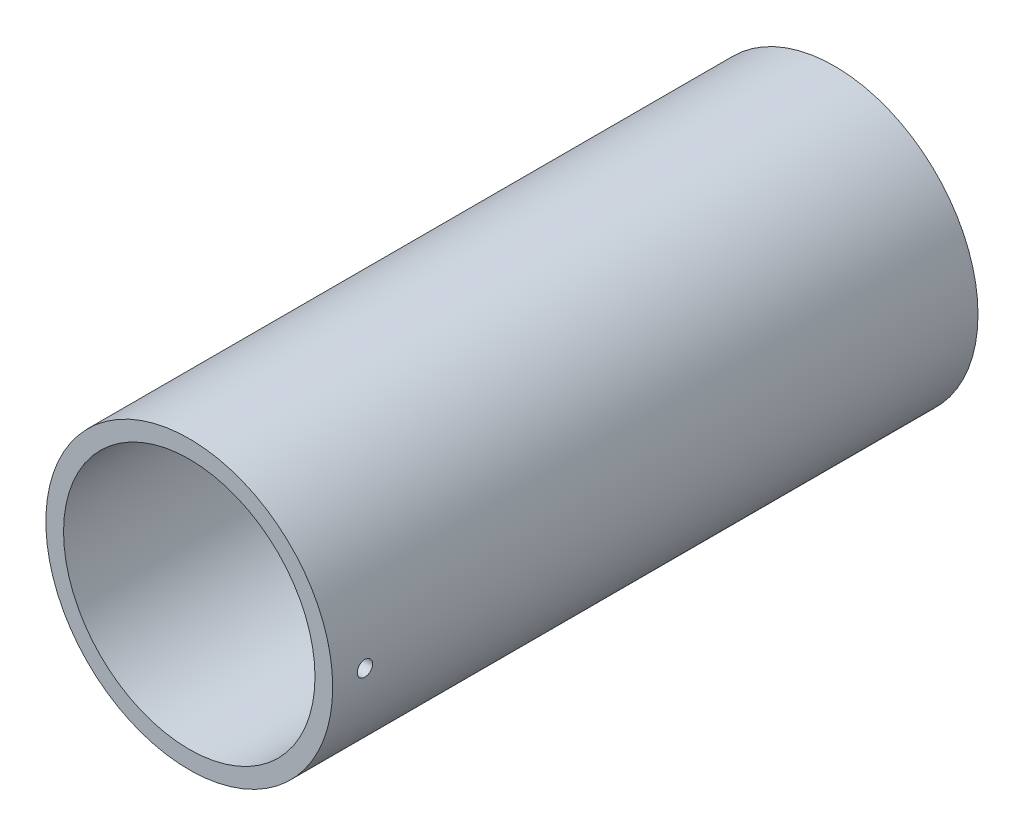
ISO-10303-21;
HEADER;
FILE_DESCRIPTION(('STEP AP214'),'2;1');
FILE_NAME('part.step','',(''),(''),'','','');
FILE_SCHEMA(('AUTOMOTIVE_DESIGN { 1 0 10303 214 1 1 1 1 }'));
ENDSEC;
DATA;
#1=APPLICATION_CONTEXT('core data for automotive mechanical design processes');
#2=APPLICATION_PROTOCOL_DEFINITION('international standard','automotive_design',2000,#1);
#3=PRODUCT_CONTEXT('',#1,'mechanical');
#4=PRODUCT('Part','Part','',(#3));
#5=PRODUCT_RELATED_PRODUCT_CATEGORY('part','',(#4));
#6=PRODUCT_DEFINITION_FORMATION('','',#4);
#7=PRODUCT_DEFINITION_CONTEXT('part definition',#1,'design');
#8=PRODUCT_DEFINITION('design','',#6,#7);
#9=PRODUCT_DEFINITION_SHAPE('','',#8);
#10=(LENGTH_UNIT() NAMED_UNIT(*) SI_UNIT(.MILLI.,.METRE.));
#11=(NAMED_UNIT(*) PLANE_ANGLE_UNIT() SI_UNIT($,.RADIAN.));
#12=(NAMED_UNIT(*) SI_UNIT($,.STERADIAN.) SOLID_ANGLE_UNIT());
#13=UNCERTAINTY_MEASURE_WITH_UNIT(LENGTH_MEASURE(1.E-05),#10,'distance_accuracy_value','');
#14=(GEOMETRIC_REPRESENTATION_CONTEXT(3) GLOBAL_UNCERTAINTY_ASSIGNED_CONTEXT((#13)) GLOBAL_UNIT_ASSIGNED_CONTEXT((#10,
#11,#12)) REPRESENTATION_CONTEXT('',''));
#15=CARTESIAN_POINT('',(0.,0.,0.));
#16=DIRECTION('',(0.,0.,1.));
#17=DIRECTION('',(1.,0.,0.));
#18=AXIS2_PLACEMENT_3D('',#15,#16,#17);
#19=CARTESIAN_POINT('',(0.,0.,100.));
#20=DIRECTION('',(0.,0.,1.));
#21=DIRECTION('',(1.,0.,0.));
#22=AXIS2_PLACEMENT_3D('',#19,#20,#21);
#23=PLANE('',#22);
#24=CARTESIAN_POINT('',(0.,0.,100.));
#25=DIRECTION('',(0.,0.,1.));
#26=DIRECTION('',(1.,0.,0.));
#27=AXIS2_PLACEMENT_3D('',#24,#25,#26);
#28=CIRCLE('',#27,44.45);
#29=CARTESIAN_POINT('',(44.45,0.,100.));
#30=VERTEX_POINT('',#29);
#31=EDGE_CURVE('E11',#30,#30,#28,.T.);
#32=ORIENTED_EDGE('',*,*,#31,.T.);
#33=EDGE_LOOP('',(#32));
#34=FACE_BOUND('',#33,.T.);
#35=CARTESIAN_POINT('',(0.,0.,100.));
#36=DIRECTION('',(0.,0.,1.));
#37=DIRECTION('',(1.,0.,0.));
#38=AXIS2_PLACEMENT_3D('',#35,#36,#37);
#39=CIRCLE('',#38,38.9636);
#40=CARTESIAN_POINT('',(38.9636,0.,100.));
#41=VERTEX_POINT('',#40);
#42=EDGE_CURVE('E48',#41,#41,#39,.T.);
#43=ORIENTED_EDGE('',*,*,#42,.F.);
#44=EDGE_LOOP('',(#43));
#45=FACE_BOUND('',#44,.T.);
#46=ADVANCED_FACE('F37',(#34,#45),#23,.T.);
#47=CARTESIAN_POINT('',(0.,0.,-100.));
#48=DIRECTION('',(0.,0.,1.));
#49=DIRECTION('',(1.,0.,0.));
#50=AXIS2_PLACEMENT_3D('',#47,#48,#49);
#51=PLANE('',#50);
#52=CARTESIAN_POINT('',(0.,0.,-100.));
#53=DIRECTION('',(0.,0.,1.));
#54=DIRECTION('',(1.,0.,0.));
#55=AXIS2_PLACEMENT_3D('',#52,#53,#54);
#56=CIRCLE('',#55,44.45);
#57=CARTESIAN_POINT('',(44.45,0.,-100.));
#58=VERTEX_POINT('',#57);
#59=EDGE_CURVE('E41',#58,#58,#56,.T.);
#60=ORIENTED_EDGE('',*,*,#59,.F.);
#61=EDGE_LOOP('',(#60));
#62=FACE_BOUND('',#61,.T.);
#63=CARTESIAN_POINT('',(0.,0.,-100.));
#64=DIRECTION('',(0.,0.,1.));
#65=DIRECTION('',(1.,0.,0.));
#66=AXIS2_PLACEMENT_3D('',#63,#64,#65);
#67=CIRCLE('',#66,38.9636);
#68=CARTESIAN_POINT('',(38.9636,0.,-100.));
#69=VERTEX_POINT('',#68);
#70=EDGE_CURVE('E50',#69,#69,#67,.T.);
#71=ORIENTED_EDGE('',*,*,#70,.T.);
#72=EDGE_LOOP('',(#71));
#73=FACE_BOUND('',#72,.T.);
#74=ADVANCED_FACE('F82',(#62,#73),#51,.F.);
#75=CARTESIAN_POINT('',(0.,0.,100.));
#76=DIRECTION('',(0.,0.,-1.));
#77=DIRECTION('',(-1.,0.,0.));
#78=AXIS2_PLACEMENT_3D('',#75,#76,#77);
#79=CYLINDRICAL_SURFACE('',#78,44.45);
#80=CARTESIAN_POINT('',(44.45,0.,92.38125));
#81=CARTESIAN_POINT('',(44.4499991480647,0.133653006651336,92.381244106041));
#82=CARTESIAN_POINT('',(44.4493907412567,0.267400480507651,92.3699598397623));
#83=CARTESIAN_POINT('',(44.4470221760507,0.531204901305171,92.3251052038379));
#84=CARTESIAN_POINT('',(44.4452606649961,0.661257326566379,92.2915086599552));
#85=CARTESIAN_POINT('',(44.4407852386706,0.913812072872783,92.2029949444128));
#86=CARTESIAN_POINT('',(44.4380718133277,1.0363182397441,92.1480887387961));
#87=CARTESIAN_POINT('',(44.4319980470234,1.27034233507233,92.01853138333));
#88=CARTESIAN_POINT('',(44.4286378576239,1.38186282865942,91.943884857872));
#89=CARTESIAN_POINT('',(44.4216442076788,1.59090977724272,91.7768716914621));
#90=CARTESIAN_POINT('',(44.4180104775736,1.68842214541644,91.6844874281983));
#91=CARTESIAN_POINT('',(44.4108816069592,1.86656464186372,91.4846568083933));
#92=CARTESIAN_POINT('',(44.4073864721499,1.94719407639736,91.3772098332101));
#93=CARTESIAN_POINT('',(44.4009269641264,2.08932232128021,91.1502279260725));
#94=CARTESIAN_POINT('',(44.3979629031319,2.15080989363801,91.030685947623));
#95=CARTESIAN_POINT('',(44.3929031488335,2.25283697716616,90.7829569299198));
#96=CARTESIAN_POINT('',(44.3908074482184,2.29337666470694,90.6547699634626));
#97=CARTESIAN_POINT('',(44.3877232251768,2.35231934942304,90.3935214135827));
#98=CARTESIAN_POINT('',(44.3867336316627,2.3707437629802,90.260464674954));
#99=CARTESIAN_POINT('',(44.38597000485,2.38499898593298,89.9931435981051));
#100=CARTESIAN_POINT('',(44.3861959608616,2.38082999402137,89.8588792705152));
#101=CARTESIAN_POINT('',(44.3878369570856,2.35003456697018,89.5930999506237));
#102=CARTESIAN_POINT('',(44.3892507716309,2.32343128008753,89.4615822675536));
#103=CARTESIAN_POINT('',(44.3931062097917,2.24855831401992,89.2048820556177));
#104=CARTESIAN_POINT('',(44.3955478382291,2.20028853319022,89.0796995564754));
#105=CARTESIAN_POINT('',(44.4011851336309,2.08342638581799,88.8391486596297));
#106=CARTESIAN_POINT('',(44.404381191478,2.01482347961208,88.7237853917362));
#107=CARTESIAN_POINT('',(44.4111667360524,1.85925013216889,88.506203795919));
#108=CARTESIAN_POINT('',(44.4147562259895,1.77227954107177,88.4039855752552));
#109=CARTESIAN_POINT('',(44.4219295261751,1.58230903740444,88.2154609571879));
#110=CARTESIAN_POINT('',(44.4255133235839,1.47928908256742,88.1291747539825));
#111=CARTESIAN_POINT('',(44.4322669749524,1.2602145998076,87.9751191708299));
#112=CARTESIAN_POINT('',(44.4354368288001,1.14416006835928,87.9073497958909));
#113=CARTESIAN_POINT('',(44.4410055270405,0.902298865448931,87.792253468662));
#114=CARTESIAN_POINT('',(44.4434043442572,0.776491850444343,87.7449272368919));
#115=CARTESIAN_POINT('',(44.4471602417947,0.51870217950518,87.6720738895769));
#116=CARTESIAN_POINT('',(44.4485173310623,0.386719576620407,87.6465465868101));
#117=CARTESIAN_POINT('',(44.4500356819924,0.120500516544731,87.6180406482422));
#118=CARTESIAN_POINT('',(44.4501984248209,-0.0137329420070242,87.6150340833012));
#119=CARTESIAN_POINT('',(44.4493136766058,-0.280797410185011,87.63158205658));
#120=CARTESIAN_POINT('',(44.4482661901676,-0.413628425146238,87.6511365089448));
#121=CARTESIAN_POINT('',(44.4450799019658,-0.674039050814118,87.7122283191362));
#122=CARTESIAN_POINT('',(44.4429417341108,-0.801621665419121,87.7537529083486));
#123=CARTESIAN_POINT('',(44.43781476448,-1.0480064708409,87.8575933108709));
#124=CARTESIAN_POINT('',(44.4348259570789,-1.16680860358537,87.9199092616756));
#125=CARTESIAN_POINT('',(44.428330140177,-1.39238824019505,88.0636348650384));
#126=CARTESIAN_POINT('',(44.4248226243069,-1.49915381229184,88.1450632214772));
#127=CARTESIAN_POINT('',(44.4176860233286,-1.69750963680294,88.3246748840985));
#128=CARTESIAN_POINT('',(44.4140569373313,-1.78909977820918,88.4228583128333));
#129=CARTESIAN_POINT('',(44.4070819846118,-1.95459901560323,88.6333132938614));
#130=CARTESIAN_POINT('',(44.4037364097874,-2.02849002846349,88.7455990774915));
#131=CARTESIAN_POINT('',(44.3977103544414,-2.15636989757077,88.980999583221));
#132=CARTESIAN_POINT('',(44.3950298707061,-2.21035884998885,89.1041142529894));
#133=CARTESIAN_POINT('',(44.3906383584122,-2.2968705756199,89.3576110120539));
#134=CARTESIAN_POINT('',(44.388926811043,-2.32940483815252,89.4879891710028));
#135=CARTESIAN_POINT('',(44.3866647260695,-2.37212121887116,89.7523668432174));
#136=CARTESIAN_POINT('',(44.38611418058,-2.38230348886897,89.8863663318813));
#137=CARTESIAN_POINT('',(44.386236376362,-2.3800254158877,90.1540029722924));
#138=CARTESIAN_POINT('',(44.3869075810382,-2.36759351476777,90.2876403677671));
#139=CARTESIAN_POINT('',(44.3893943814467,-2.32049883607576,90.5509276735763));
#140=CARTESIAN_POINT('',(44.3912099793345,-2.28583601663112,90.6805775763998));
#141=CARTESIAN_POINT('',(44.3957805871013,-2.19526944469619,90.9322150619965));
#142=CARTESIAN_POINT('',(44.3985356008229,-2.13936560532062,91.0542026134249));
#143=CARTESIAN_POINT('',(44.4046744643408,-2.00790845763157,91.2870628770272));
#144=CARTESIAN_POINT('',(44.4080582956347,-1.93235572744112,91.3979359160869));
#145=CARTESIAN_POINT('',(44.4150783171195,-1.76364241046159,91.6055627171846));
#146=CARTESIAN_POINT('',(44.4187147922135,-1.67046173403725,91.7023001444644));
#147=CARTESIAN_POINT('',(44.4258281004212,-1.46915578860374,91.8787902008385));
#148=CARTESIAN_POINT('',(44.4293048940992,-1.36102685405004,91.9585386517474));
#149=CARTESIAN_POINT('',(44.4357097799733,-1.13279891630671,92.098829868871));
#150=CARTESIAN_POINT('',(44.4386373027828,-1.01268768733893,92.1593527499573));
#151=CARTESIAN_POINT('',(44.4436055218138,-0.76408202878234,92.2593004041808));
#152=CARTESIAN_POINT('',(44.4456472626514,-0.635597680646736,92.2987500420864));
#153=CARTESIAN_POINT('',(44.4480751309977,-0.421931861885016,92.3451084620936));
#154=CARTESIAN_POINT('',(44.4487937752493,-0.338133618508708,92.358644177428));
#155=CARTESIAN_POINT('',(44.4497564797954,-0.169569593601955,92.3767168118116));
#156=CARTESIAN_POINT('',(44.4500005405592,-0.0848038130284541,92.3812537397602));
#157=CARTESIAN_POINT('',(44.45,0.,92.38125));
#158=B_SPLINE_CURVE_WITH_KNOTS('',3,(#80,#81,#82,#83,#84,#85,#86,#87,#88,#89,#90,#91,#92,#93,
#94,#95,#96,#97,#98,#99,#100,#101,#102,#103,#104,#105,#106,#107,#108,#109,#110,#111,#112,#113,
#114,#115,#116,#117,#118,#119,#120,#121,#122,#123,#124,#125,#126,#127,#128,#129,#130,#131,#132,
#133,#134,#135,#136,#137,#138,#139,#140,#141,#142,#143,#144,#145,#146,#147,#148,#149,#150,#151,
#152,#153,#154,#155,#156,#157),.UNSPECIFIED.,.T.,.F.,(4,2,2,2,2,2,2,2,2,2,2,2,2,2,2,2,2,2,2,2,2,
2,2,2,2,2,2,2,2,2,2,2,2,2,2,2,2,2,4),(0.,0.400649449517668,0.801769727741885,1.20268386087006,
1.60350415843934,2.00472474806217,2.40596182108431,2.80743401397652,3.20890282662375,
3.60998254329759,4.01105873276921,4.41172158761796,4.81238632212928,5.21325910526814,
5.61413515920861,6.01551589598167,6.41689674131856,6.81829173219276,7.21968327561918,
7.62057694994525,8.02146909869364,8.42212851227741,8.82279057550296,9.22384638366979,
9.62490512542497,10.0263718959657,10.4278367265068,10.8290863914317,11.2303333311133,
11.6310759711064,12.0318193659115,12.432564399954,12.833297644337,13.2344903647557,
13.6357816389267,14.0374866298568,14.4387165876637,14.6929318534464,14.9471468678193),.UNSPECIFIED.);
#159=CARTESIAN_POINT('',(44.45,0.,92.38125));
#160=VERTEX_POINT('',#159);
#161=EDGE_CURVE('E62',#160,#160,#158,.T.);
#162=ORIENTED_EDGE('',*,*,#161,.T.);
#163=EDGE_LOOP('',(#162));
#164=FACE_BOUND('',#163,.T.);
#165=ORIENTED_EDGE('',*,*,#31,.F.);
#166=EDGE_LOOP('',(#165));
#167=FACE_BOUND('',#166,.T.);
#168=ORIENTED_EDGE('',*,*,#59,.T.);
#169=EDGE_LOOP('',(#168));
#170=FACE_BOUND('',#169,.T.);
#171=ADVANCED_FACE('F39',(#164,#167,#170),#79,.T.);
#172=CARTESIAN_POINT('',(0.,0.,100.));
#173=DIRECTION('',(0.,0.,-1.));
#174=DIRECTION('',(-1.,0.,0.));
#175=AXIS2_PLACEMENT_3D('',#172,#173,#174);
#176=CYLINDRICAL_SURFACE('',#175,38.9636);
#177=CARTESIAN_POINT('',(38.9636,0.,92.38125));
#178=CARTESIAN_POINT('',(38.9635990319234,0.133622047819545,92.3812441183981));
#179=CARTESIAN_POINT('',(38.9629052810965,0.267337803047096,92.3699650579585));
#180=CARTESIAN_POINT('',(38.9602044675603,0.531077538523122,92.3251323064162));
#181=CARTESIAN_POINT('',(38.9581958740227,0.661097030994969,92.2915526507994));
#182=CARTESIAN_POINT('',(38.9530926146857,0.913585753278249,92.2030864216845));
#183=CARTESIAN_POINT('',(38.9499985195146,1.03605891036957,92.1482110413531));
#184=CARTESIAN_POINT('',(38.9430723132873,1.2700234965248,92.018729104857));
#185=CARTESIAN_POINT('',(38.939240371937,1.38151744193142,91.9441270843842));
#186=CARTESIAN_POINT('',(38.9312630789038,1.59055123490735,91.7771917754106));
#187=CARTESIAN_POINT('',(38.927117336207,1.68807322016398,91.6848361368497));
#188=CARTESIAN_POINT('',(38.9189830314891,1.86624210146664,91.4850611555689));
#189=CARTESIAN_POINT('',(38.9149944760235,1.94688829431563,91.3776411854451));
#190=CARTESIAN_POINT('',(38.9076213477326,2.08907085080945,91.150686332674));
#191=CARTESIAN_POINT('',(38.9042372421963,2.15059245655991,91.0311421880223));
#192=CARTESIAN_POINT('',(38.8984596737926,2.25268501138181,90.7833973652321));
#193=CARTESIAN_POINT('',(38.8960662006544,2.29325617766705,90.6551967768591));
#194=CARTESIAN_POINT('',(38.892543516058,2.35224682618386,90.3939495998746));
#195=CARTESIAN_POINT('',(38.8914127141255,2.37069417798468,90.2609093261135));
#196=CARTESIAN_POINT('',(38.890538128088,2.38499957266789,89.9936161146798));
#197=CARTESIAN_POINT('',(38.8907943288547,2.38085786193411,89.8593631902498));
#198=CARTESIAN_POINT('',(38.8926633796992,2.35012583668612,89.5936454708697));
#199=CARTESIAN_POINT('',(38.8942744075049,2.32356567530464,89.462177173911));
#200=CARTESIAN_POINT('',(38.8986686865473,2.24879745890378,89.205568488909));
#201=CARTESIAN_POINT('',(38.9014519445564,2.20058927881746,89.0804281374288));
#202=CARTESIAN_POINT('',(38.9078791209155,2.08385922271199,88.8399307165839));
#203=CARTESIAN_POINT('',(38.9115236188119,2.01532366001449,88.7245803064272));
#204=CARTESIAN_POINT('',(38.9192619747383,1.85989423675113,88.5070099510318));
#205=CARTESIAN_POINT('',(38.9233558375911,1.77300017914303,88.4047901467432));
#206=CARTESIAN_POINT('',(38.9315396565354,1.58315050160668,88.2162072037603));
#207=CARTESIAN_POINT('',(38.9356295952194,1.48016878396889,88.1298703351344));
#208=CARTESIAN_POINT('',(38.9433381954654,1.2611585781134,87.9757066596055));
#209=CARTESIAN_POINT('',(38.9469568568693,1.14513008552118,87.9078798589089));
#210=CARTESIAN_POINT('',(38.9533153972565,0.90330409000844,87.7926639337856));
#211=CARTESIAN_POINT('',(38.9560552338659,0.777506116400544,87.7452757948024));
#212=CARTESIAN_POINT('',(38.960346802955,0.519719183562238,87.6722998718184));
#213=CARTESIAN_POINT('',(38.9618985487032,0.387730293489434,87.6467118443536));
#214=CARTESIAN_POINT('',(38.9636373659496,0.121536153177659,87.6180950252081));
#215=CARTESIAN_POINT('',(38.9638266347012,-0.0126651785296491,87.6150299108793));
#216=CARTESIAN_POINT('',(38.9628250128404,-0.279675107405246,87.6314510340184));
#217=CARTESIAN_POINT('',(38.9616341290909,-0.412483711495709,87.6509371593478));
#218=CARTESIAN_POINT('',(38.9580076886754,-0.672835976632644,87.7118775484378));
#219=CARTESIAN_POINT('',(38.9555730757049,-0.800383550368106,87.7533151571069));
#220=CARTESIAN_POINT('',(38.949733103779,-1.04671388212944,87.8569653387713));
#221=CARTESIAN_POINT('',(38.9463277364726,-1.16549656474307,87.9191780904886));
#222=CARTESIAN_POINT('',(38.938923475618,-1.39109169689793,88.0627050944447));
#223=CARTESIAN_POINT('',(38.934923830348,-1.49788868055557,88.144043616539));
#224=CARTESIAN_POINT('',(38.9267836883203,-1.69632517095731,88.3234779163209));
#225=CARTESIAN_POINT('',(38.9226431902354,-1.78796453480621,88.4215738519676));
#226=CARTESIAN_POINT('',(38.9146816555532,-1.95360742881735,88.6318950483051));
#227=CARTESIAN_POINT('',(38.9108610500373,-2.02758740217108,88.7441388801972));
#228=CARTESIAN_POINT('',(38.9039770052016,-2.15565037466462,88.9794762770185));
#229=CARTESIAN_POINT('',(38.9009135613788,-2.20973349213608,89.1025697774166));
#230=CARTESIAN_POINT('',(38.895892414783,-2.29642670582181,89.3560261453967));
#231=CARTESIAN_POINT('',(38.8939339474572,-2.32905165192436,89.4863839179101));
#232=CARTESIAN_POINT('',(38.8913414882927,-2.37195092775078,89.7507392926309));
#233=CARTESIAN_POINT('',(38.8907074839957,-2.38222546770791,89.8847368605897));
#234=CARTESIAN_POINT('',(38.8908357494978,-2.38013025803826,90.1523338639311));
#235=CARTESIAN_POINT('',(38.8915957355226,-2.36779754589006,90.2859335919809));
#236=CARTESIAN_POINT('',(38.8944215014216,-2.32091467373742,90.5491615951183));
#237=CARTESIAN_POINT('',(38.8964872836783,-2.28636447319459,90.678789862959));
#238=CARTESIAN_POINT('',(38.901691288564,-2.19603562961131,90.9304011040684));
#239=CARTESIAN_POINT('',(38.9048295057256,-2.14025709479347,91.0523841163093));
#240=CARTESIAN_POINT('',(38.9118246646171,-2.00906015069545,91.2852584240075));
#241=CARTESIAN_POINT('',(38.9156815873124,-1.93364226153321,91.3961500130965));
#242=CARTESIAN_POINT('',(38.9236868643467,-1.76517090520433,91.6038812286531));
#243=CARTESIAN_POINT('',(38.92783565367,-1.67209074900428,91.7006991926466));
#244=CARTESIAN_POINT('',(38.9359534973174,-1.4709712739758,91.8773683541463));
#245=CARTESIAN_POINT('',(38.9399225073887,-1.36292829830774,91.957215391913));
#246=CARTESIAN_POINT('',(38.947237501942,-1.13483180200476,92.0977322989381));
#247=CARTESIAN_POINT('',(38.9505827312368,-1.01476399009241,92.1583789842339));
#248=CARTESIAN_POINT('',(38.9562629606559,-0.766217293763431,92.2585783380326));
#249=CARTESIAN_POINT('',(38.9585991445503,-0.637748470000228,92.2981557368933));
#250=CARTESIAN_POINT('',(38.9613851485649,-0.423743494070706,92.3447950693505));
#251=CARTESIAN_POINT('',(38.9622120316238,-0.339591006520779,92.3584480184187));
#252=CARTESIAN_POINT('',(38.9633197655112,-0.170305035819368,92.3766773522559));
#253=CARTESIAN_POINT('',(38.9636006170583,-0.0851715539591736,92.3812537489709));
#254=CARTESIAN_POINT('',(38.9636,0.,92.38125));
#255=B_SPLINE_CURVE_WITH_KNOTS('',3,(#177,#178,#179,#180,#181,#182,#183,#184,#185,#186,#187,
#188,#189,#190,#191,#192,#193,#194,#195,#196,#197,#198,#199,#200,#201,#202,#203,#204,#205,#206,
#207,#208,#209,#210,#211,#212,#213,#214,#215,#216,#217,#218,#219,#220,#221,#222,#223,#224,#225,
#226,#227,#228,#229,#230,#231,#232,#233,#234,#235,#236,#237,#238,#239,#240,#241,#242,#243,#244,
#245,#246,#247,#248,#249,#250,#251,#252,#253,#254),.UNSPECIFIED.,.T.,.F.,(4,2,2,2,2,2,2,2,2,2,2,
2,2,2,2,2,2,2,2,2,2,2,2,2,2,2,2,2,2,2,2,2,2,2,2,2,2,2,4),(0.,0.40055521901039,0.801577622766,
1.20238953148518,1.60310936263957,2.00433700407311,2.40558136092502,2.80713458228092,
3.20868364025628,3.60972633014136,4.01076464577498,4.41126441716731,4.81176650239383,
5.21253886518162,5.61331552968926,6.01474922551876,6.41618305594682,6.81763623921422,
7.2190849389884,7.61988608102514,8.020685230044,8.42118071821927,8.82167965181579,
9.2226895720301,9.62370327246331,10.0252489540468,10.4267922474974,10.8280573641859,
11.2293187064624,11.6299232494076,12.0305285233044,12.4311317549324,12.8317243782821,
13.232927218859,13.6342282850456,14.0360120806445,14.4373232314735,14.6926400441417,
14.9479565207732),.UNSPECIFIED.);
#256=CARTESIAN_POINT('',(38.9636,0.,92.38125));
#257=VERTEX_POINT('',#256);
#258=EDGE_CURVE('E53',#257,#257,#255,.T.);
#259=ORIENTED_EDGE('',*,*,#258,.F.);
#260=EDGE_LOOP('',(#259));
#261=FACE_BOUND('',#260,.T.);
#262=ORIENTED_EDGE('',*,*,#42,.T.);
#263=EDGE_LOOP('',(#262));
#264=FACE_BOUND('',#263,.T.);
#265=ORIENTED_EDGE('',*,*,#70,.F.);
#266=EDGE_LOOP('',(#265));
#267=FACE_BOUND('',#266,.T.);
#268=ADVANCED_FACE('F66',(#261,#264,#267),#176,.F.);
#269=CARTESIAN_POINT('',(0.,0.,90.));
#270=DIRECTION('',(-1.,0.,0.));
#271=DIRECTION('',(0.,0.,1.));
#272=AXIS2_PLACEMENT_3D('',#269,#270,#271);
#273=CYLINDRICAL_SURFACE('',#272,2.38124999999999);
#274=ORIENTED_EDGE('',*,*,#258,.T.);
#275=EDGE_LOOP('',(#274));
#276=FACE_BOUND('',#275,.T.);
#277=ORIENTED_EDGE('',*,*,#161,.F.);
#278=EDGE_LOOP('',(#277));
#279=FACE_BOUND('',#278,.T.);
#280=ADVANCED_FACE('F69',(#276,#279),#273,.F.);
#281=CLOSED_SHELL('',(#46,#74,#171,#268,#280));
#282=MANIFOLD_SOLID_BREP('B2',#281);
#283=ADVANCED_BREP_SHAPE_REPRESENTATION('',(#18,#282),#14);
#284=SHAPE_DEFINITION_REPRESENTATION(#9,#283);
ENDSEC;
END-ISO-10303-21;
